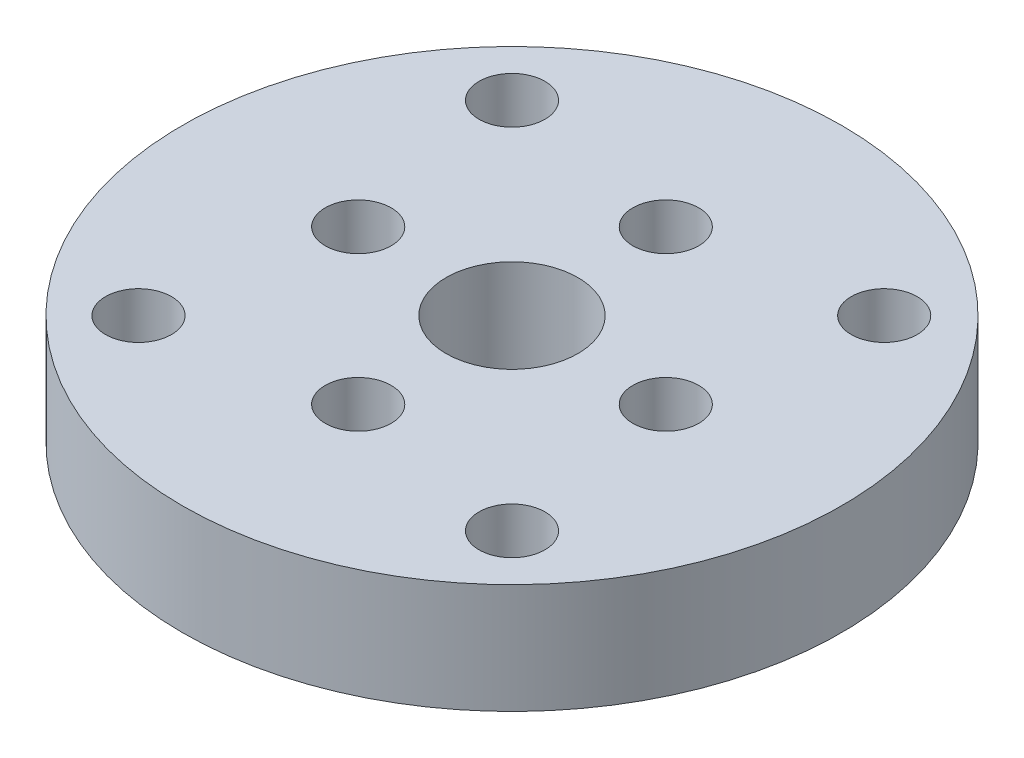
ISO-10303-21;
HEADER;
FILE_DESCRIPTION(('STEP AP214'),'2;1');
FILE_NAME('part.step','',(''),(''),'','','');
FILE_SCHEMA(('AUTOMOTIVE_DESIGN { 1 0 10303 214 1 1 1 1 }'));
ENDSEC;
DATA;
#1=APPLICATION_CONTEXT('core data for automotive mechanical design processes');
#2=APPLICATION_PROTOCOL_DEFINITION('international standard','automotive_design',2000,#1);
#3=PRODUCT_CONTEXT('',#1,'mechanical');
#4=PRODUCT('Part','Part','',(#3));
#5=PRODUCT_RELATED_PRODUCT_CATEGORY('part','',(#4));
#6=PRODUCT_DEFINITION_FORMATION('','',#4);
#7=PRODUCT_DEFINITION_CONTEXT('part definition',#1,'design');
#8=PRODUCT_DEFINITION('design','',#6,#7);
#9=PRODUCT_DEFINITION_SHAPE('','',#8);
#10=(LENGTH_UNIT() NAMED_UNIT(*) SI_UNIT(.MILLI.,.METRE.));
#11=(NAMED_UNIT(*) PLANE_ANGLE_UNIT() SI_UNIT($,.RADIAN.));
#12=(NAMED_UNIT(*) SI_UNIT($,.STERADIAN.) SOLID_ANGLE_UNIT());
#13=UNCERTAINTY_MEASURE_WITH_UNIT(LENGTH_MEASURE(1.E-05),#10,'distance_accuracy_value','');
#14=(GEOMETRIC_REPRESENTATION_CONTEXT(3) GLOBAL_UNCERTAINTY_ASSIGNED_CONTEXT((#13)) GLOBAL_UNIT_ASSIGNED_CONTEXT((#10,
#11,#12)) REPRESENTATION_CONTEXT('',''));
#15=CARTESIAN_POINT('',(0.,0.,0.));
#16=DIRECTION('',(0.,0.,1.));
#17=DIRECTION('',(1.,0.,0.));
#18=AXIS2_PLACEMENT_3D('',#15,#16,#17);
#19=CARTESIAN_POINT('',(0.,5.,0.));
#20=DIRECTION('',(0.,-1.,0.));
#21=DIRECTION('',(0.,0.,-1.));
#22=AXIS2_PLACEMENT_3D('',#19,#20,#21);
#23=CYLINDRICAL_SURFACE('',#22,15.);
#24=CARTESIAN_POINT('',(0.,5.,0.));
#25=DIRECTION('',(0.,1.,0.));
#26=DIRECTION('',(0.,0.,1.));
#27=AXIS2_PLACEMENT_3D('',#24,#25,#26);
#28=CIRCLE('',#27,15.);
#29=CARTESIAN_POINT('',(0.,5.,15.));
#30=VERTEX_POINT('',#29);
#31=EDGE_CURVE('E10',#30,#30,#28,.T.);
#32=ORIENTED_EDGE('',*,*,#31,.F.);
#33=EDGE_LOOP('',(#32));
#34=FACE_BOUND('',#33,.T.);
#35=CARTESIAN_POINT('',(0.,0.,0.));
#36=DIRECTION('',(0.,1.,0.));
#37=DIRECTION('',(0.,0.,1.));
#38=AXIS2_PLACEMENT_3D('',#35,#36,#37);
#39=CIRCLE('',#38,15.);
#40=CARTESIAN_POINT('',(0.,0.,15.));
#41=VERTEX_POINT('',#40);
#42=EDGE_CURVE('E39',#41,#41,#39,.T.);
#43=ORIENTED_EDGE('',*,*,#42,.T.);
#44=EDGE_LOOP('',(#43));
#45=FACE_BOUND('',#44,.T.);
#46=ADVANCED_FACE('F32',(#34,#45),#23,.T.);
#47=CARTESIAN_POINT('',(0.,5.,0.));
#48=DIRECTION('',(0.,1.,0.));
#49=DIRECTION('',(0.,0.,1.));
#50=AXIS2_PLACEMENT_3D('',#47,#48,#49);
#51=PLANE('',#50);
#52=CARTESIAN_POINT('',(0.,5.,0.));
#53=DIRECTION('',(0.,1.,0.));
#54=DIRECTION('',(0.,0.,1.));
#55=AXIS2_PLACEMENT_3D('',#52,#53,#54);
#56=CIRCLE('',#55,3.);
#57=CARTESIAN_POINT('',(0.,5.,3.));
#58=VERTEX_POINT('',#57);
#59=EDGE_CURVE('E93',#58,#58,#56,.T.);
#60=ORIENTED_EDGE('',*,*,#59,.F.);
#61=EDGE_LOOP('',(#60));
#62=FACE_BOUND('',#61,.T.);
#63=CARTESIAN_POINT('',(7.,5.,3.70363462121048E-13));
#64=DIRECTION('',(0.,1.,0.));
#65=DIRECTION('',(0.,0.,1.));
#66=AXIS2_PLACEMENT_3D('',#63,#64,#65);
#67=CIRCLE('',#66,1.50000000000042);
#68=CARTESIAN_POINT('',(7.,5.,1.50000000000079));
#69=VERTEX_POINT('',#68);
#70=EDGE_CURVE('E88',#69,#69,#67,.T.);
#71=ORIENTED_EDGE('',*,*,#70,.F.);
#72=EDGE_LOOP('',(#71));
#73=FACE_BOUND('',#72,.T.);
#74=CARTESIAN_POINT('',(1.99926880606327E-13,5.,7.0000000000002));
#75=DIRECTION('',(0.,1.,0.));
#76=DIRECTION('',(0.,0.,1.));
#77=AXIS2_PLACEMENT_3D('',#74,#75,#76);
#78=CIRCLE('',#77,1.50000000000026);
#79=CARTESIAN_POINT('',(1.99926880606327E-13,5.,8.50000000000046));
#80=VERTEX_POINT('',#79);
#81=EDGE_CURVE('E82',#80,#80,#78,.T.);
#82=ORIENTED_EDGE('',*,*,#81,.F.);
#83=EDGE_LOOP('',(#82));
#84=FACE_BOUND('',#83,.T.);
#85=CARTESIAN_POINT('',(-7.,5.,3.94649590784724E-13));
#86=DIRECTION('',(0.,1.,0.));
#87=DIRECTION('',(0.,0.,1.));
#88=AXIS2_PLACEMENT_3D('',#85,#86,#87);
#89=CIRCLE('',#88,1.50000000000036);
#90=CARTESIAN_POINT('',(-7.,5.,1.50000000000075));
#91=VERTEX_POINT('',#90);
#92=EDGE_CURVE('E76',#91,#91,#89,.T.);
#93=ORIENTED_EDGE('',*,*,#92,.F.);
#94=EDGE_LOOP('',(#93));
#95=FACE_BOUND('',#94,.T.);
#96=CARTESIAN_POINT('',(1.75207071073658E-13,5.,-6.9999999999998));
#97=DIRECTION('',(0.,1.,0.));
#98=DIRECTION('',(0.,0.,1.));
#99=AXIS2_PLACEMENT_3D('',#96,#97,#98);
#100=CIRCLE('',#99,1.50000000000032);
#101=CARTESIAN_POINT('',(1.75207071073658E-13,5.,-5.49999999999949));
#102=VERTEX_POINT('',#101);
#103=EDGE_CURVE('E70',#102,#102,#100,.T.);
#104=ORIENTED_EDGE('',*,*,#103,.F.);
#105=EDGE_LOOP('',(#104));
#106=FACE_BOUND('',#105,.T.);
#107=CARTESIAN_POINT('',(8.48528137423856,5.,8.48528137423856));
#108=DIRECTION('',(0.,-1.,0.));
#109=DIRECTION('',(0.,0.,-1.));
#110=AXIS2_PLACEMENT_3D('',#107,#108,#109);
#111=CIRCLE('',#110,1.5);
#112=CARTESIAN_POINT('',(8.48528137423856,5.,6.98528137423857));
#113=VERTEX_POINT('',#112);
#114=EDGE_CURVE('E49',#113,#113,#111,.T.);
#115=ORIENTED_EDGE('',*,*,#114,.T.);
#116=EDGE_LOOP('',(#115));
#117=FACE_BOUND('',#116,.T.);
#118=CARTESIAN_POINT('',(-8.48528137423857,5.,-8.48528137423857));
#119=DIRECTION('',(0.,-1.,0.));
#120=DIRECTION('',(0.,0.,-1.));
#121=AXIS2_PLACEMENT_3D('',#118,#119,#120);
#122=CIRCLE('',#121,1.5);
#123=CARTESIAN_POINT('',(-8.48528137423857,5.,-9.98528137423857));
#124=VERTEX_POINT('',#123);
#125=EDGE_CURVE('E55',#124,#124,#122,.T.);
#126=ORIENTED_EDGE('',*,*,#125,.T.);
#127=EDGE_LOOP('',(#126));
#128=FACE_BOUND('',#127,.T.);
#129=CARTESIAN_POINT('',(8.47056274847714,5.,-8.47056274847714));
#130=DIRECTION('',(0.,-1.,0.));
#131=DIRECTION('',(0.,0.,-1.));
#132=AXIS2_PLACEMENT_3D('',#129,#130,#131);
#133=CIRCLE('',#132,1.5);
#134=CARTESIAN_POINT('',(8.47056274847714,5.,-9.97056274847714));
#135=VERTEX_POINT('',#134);
#136=EDGE_CURVE('E56',#135,#135,#133,.T.);
#137=ORIENTED_EDGE('',*,*,#136,.T.);
#138=EDGE_LOOP('',(#137));
#139=FACE_BOUND('',#138,.T.);
#140=CARTESIAN_POINT('',(-8.5,5.,8.5));
#141=DIRECTION('',(0.,-1.,0.));
#142=DIRECTION('',(0.,0.,-1.));
#143=AXIS2_PLACEMENT_3D('',#140,#141,#142);
#144=CIRCLE('',#143,1.5);
#145=CARTESIAN_POINT('',(-8.5,5.,7.));
#146=VERTEX_POINT('',#145);
#147=EDGE_CURVE('E44',#146,#146,#144,.T.);
#148=ORIENTED_EDGE('',*,*,#147,.T.);
#149=EDGE_LOOP('',(#148));
#150=FACE_BOUND('',#149,.T.);
#151=ORIENTED_EDGE('',*,*,#31,.T.);
#152=EDGE_LOOP('',(#151));
#153=FACE_BOUND('',#152,.T.);
#154=ADVANCED_FACE('F114',(#62,#73,#84,#95,#106,#117,#128,#139,#150,#153),#51,.T.);
#155=CARTESIAN_POINT('',(0.,0.,0.));
#156=DIRECTION('',(0.,1.,0.));
#157=DIRECTION('',(0.,0.,1.));
#158=AXIS2_PLACEMENT_3D('',#155,#156,#157);
#159=PLANE('',#158);
#160=CARTESIAN_POINT('',(0.,0.,0.));
#161=DIRECTION('',(0.,1.,0.));
#162=DIRECTION('',(0.,0.,1.));
#163=AXIS2_PLACEMENT_3D('',#160,#161,#162);
#164=CIRCLE('',#163,3.);
#165=CARTESIAN_POINT('',(0.,0.,3.));
#166=VERTEX_POINT('',#165);
#167=EDGE_CURVE('E35',#166,#166,#164,.T.);
#168=ORIENTED_EDGE('',*,*,#167,.T.);
#169=EDGE_LOOP('',(#168));
#170=FACE_BOUND('',#169,.T.);
#171=CARTESIAN_POINT('',(7.,0.,3.70363462121048E-13));
#172=DIRECTION('',(0.,1.,0.));
#173=DIRECTION('',(0.,0.,1.));
#174=AXIS2_PLACEMENT_3D('',#171,#172,#173);
#175=CIRCLE('',#174,1.50000000000042);
#176=CARTESIAN_POINT('',(7.,0.,1.50000000000079));
#177=VERTEX_POINT('',#176);
#178=EDGE_CURVE('E67',#177,#177,#175,.T.);
#179=ORIENTED_EDGE('',*,*,#178,.T.);
#180=EDGE_LOOP('',(#179));
#181=FACE_BOUND('',#180,.T.);
#182=CARTESIAN_POINT('',(1.99926880606327E-13,0.,7.0000000000002));
#183=DIRECTION('',(0.,1.,0.));
#184=DIRECTION('',(0.,0.,1.));
#185=AXIS2_PLACEMENT_3D('',#182,#183,#184);
#186=CIRCLE('',#185,1.50000000000026);
#187=CARTESIAN_POINT('',(1.99926880606327E-13,0.,8.50000000000046));
#188=VERTEX_POINT('',#187);
#189=EDGE_CURVE('E85',#188,#188,#186,.T.);
#190=ORIENTED_EDGE('',*,*,#189,.T.);
#191=EDGE_LOOP('',(#190));
#192=FACE_BOUND('',#191,.T.);
#193=CARTESIAN_POINT('',(-7.,0.,3.94649590784724E-13));
#194=DIRECTION('',(0.,1.,0.));
#195=DIRECTION('',(0.,0.,1.));
#196=AXIS2_PLACEMENT_3D('',#193,#194,#195);
#197=CIRCLE('',#196,1.50000000000036);
#198=CARTESIAN_POINT('',(-7.,0.,1.50000000000075));
#199=VERTEX_POINT('',#198);
#200=EDGE_CURVE('E79',#199,#199,#197,.T.);
#201=ORIENTED_EDGE('',*,*,#200,.T.);
#202=EDGE_LOOP('',(#201));
#203=FACE_BOUND('',#202,.T.);
#204=CARTESIAN_POINT('',(1.75207071073658E-13,0.,-6.9999999999998));
#205=DIRECTION('',(0.,1.,0.));
#206=DIRECTION('',(0.,0.,1.));
#207=AXIS2_PLACEMENT_3D('',#204,#205,#206);
#208=CIRCLE('',#207,1.50000000000032);
#209=CARTESIAN_POINT('',(1.75207071073658E-13,0.,-5.49999999999949));
#210=VERTEX_POINT('',#209);
#211=EDGE_CURVE('E73',#210,#210,#208,.T.);
#212=ORIENTED_EDGE('',*,*,#211,.T.);
#213=EDGE_LOOP('',(#212));
#214=FACE_BOUND('',#213,.T.);
#215=CARTESIAN_POINT('',(8.48528137423856,0.,8.48528137423856));
#216=DIRECTION('',(0.,-1.,0.));
#217=DIRECTION('',(0.,0.,-1.));
#218=AXIS2_PLACEMENT_3D('',#215,#216,#217);
#219=CIRCLE('',#218,1.5);
#220=CARTESIAN_POINT('',(8.48528137423856,0.,6.98528137423857));
#221=VERTEX_POINT('',#220);
#222=EDGE_CURVE('E59',#221,#221,#219,.T.);
#223=ORIENTED_EDGE('',*,*,#222,.F.);
#224=EDGE_LOOP('',(#223));
#225=FACE_BOUND('',#224,.T.);
#226=CARTESIAN_POINT('',(-8.48528137423857,0.,-8.48528137423857));
#227=DIRECTION('',(0.,-1.,0.));
#228=DIRECTION('',(0.,0.,-1.));
#229=AXIS2_PLACEMENT_3D('',#226,#227,#228);
#230=CIRCLE('',#229,1.5);
#231=CARTESIAN_POINT('',(-8.48528137423857,0.,-9.98528137423857));
#232=VERTEX_POINT('',#231);
#233=EDGE_CURVE('E52',#232,#232,#230,.T.);
#234=ORIENTED_EDGE('',*,*,#233,.F.);
#235=EDGE_LOOP('',(#234));
#236=FACE_BOUND('',#235,.T.);
#237=CARTESIAN_POINT('',(8.47056274847714,0.,-8.47056274847714));
#238=DIRECTION('',(0.,-1.,0.));
#239=DIRECTION('',(0.,0.,-1.));
#240=AXIS2_PLACEMENT_3D('',#237,#238,#239);
#241=CIRCLE('',#240,1.5);
#242=CARTESIAN_POINT('',(8.47056274847714,0.,-9.97056274847714));
#243=VERTEX_POINT('',#242);
#244=EDGE_CURVE('E64',#243,#243,#241,.T.);
#245=ORIENTED_EDGE('',*,*,#244,.F.);
#246=EDGE_LOOP('',(#245));
#247=FACE_BOUND('',#246,.T.);
#248=CARTESIAN_POINT('',(-8.5,0.,8.5));
#249=DIRECTION('',(0.,-1.,0.));
#250=DIRECTION('',(0.,0.,-1.));
#251=AXIS2_PLACEMENT_3D('',#248,#249,#250);
#252=CIRCLE('',#251,1.5);
#253=CARTESIAN_POINT('',(-8.5,0.,7.));
#254=VERTEX_POINT('',#253);
#255=EDGE_CURVE('E46',#254,#254,#252,.T.);
#256=ORIENTED_EDGE('',*,*,#255,.F.);
#257=EDGE_LOOP('',(#256));
#258=FACE_BOUND('',#257,.T.);
#259=ORIENTED_EDGE('',*,*,#42,.F.);
#260=EDGE_LOOP('',(#259));
#261=FACE_BOUND('',#260,.T.);
#262=ADVANCED_FACE('F100',(#170,#181,#192,#203,#214,#225,#236,#247,#258,#261),#159,.F.);
#263=CARTESIAN_POINT('',(-8.5,5.,8.5));
#264=DIRECTION('',(0.,-1.,0.));
#265=DIRECTION('',(0.,0.,-1.));
#266=AXIS2_PLACEMENT_3D('',#263,#264,#265);
#267=CYLINDRICAL_SURFACE('',#266,1.5);
#268=ORIENTED_EDGE('',*,*,#147,.F.);
#269=EDGE_LOOP('',(#268));
#270=FACE_BOUND('',#269,.T.);
#271=ORIENTED_EDGE('',*,*,#255,.T.);
#272=EDGE_LOOP('',(#271));
#273=FACE_BOUND('',#272,.T.);
#274=ADVANCED_FACE('F126',(#270,#273),#267,.F.);
#275=CARTESIAN_POINT('',(8.47056274847714,5.,-8.47056274847714));
#276=DIRECTION('',(0.,-1.,0.));
#277=DIRECTION('',(0.,0.,-1.));
#278=AXIS2_PLACEMENT_3D('',#275,#276,#277);
#279=CYLINDRICAL_SURFACE('',#278,1.5);
#280=ORIENTED_EDGE('',*,*,#136,.F.);
#281=EDGE_LOOP('',(#280));
#282=FACE_BOUND('',#281,.T.);
#283=ORIENTED_EDGE('',*,*,#244,.T.);
#284=EDGE_LOOP('',(#283));
#285=FACE_BOUND('',#284,.T.);
#286=ADVANCED_FACE('F130',(#282,#285),#279,.F.);
#287=CARTESIAN_POINT('',(-8.48528137423857,5.,-8.48528137423857));
#288=DIRECTION('',(0.,-1.,0.));
#289=DIRECTION('',(0.,0.,-1.));
#290=AXIS2_PLACEMENT_3D('',#287,#288,#289);
#291=CYLINDRICAL_SURFACE('',#290,1.5);
#292=ORIENTED_EDGE('',*,*,#125,.F.);
#293=EDGE_LOOP('',(#292));
#294=FACE_BOUND('',#293,.T.);
#295=ORIENTED_EDGE('',*,*,#233,.T.);
#296=EDGE_LOOP('',(#295));
#297=FACE_BOUND('',#296,.T.);
#298=ADVANCED_FACE('F134',(#294,#297),#291,.F.);
#299=CARTESIAN_POINT('',(8.48528137423856,5.,8.48528137423856));
#300=DIRECTION('',(0.,-1.,0.));
#301=DIRECTION('',(0.,0.,-1.));
#302=AXIS2_PLACEMENT_3D('',#299,#300,#301);
#303=CYLINDRICAL_SURFACE('',#302,1.5);
#304=ORIENTED_EDGE('',*,*,#114,.F.);
#305=EDGE_LOOP('',(#304));
#306=FACE_BOUND('',#305,.T.);
#307=ORIENTED_EDGE('',*,*,#222,.T.);
#308=EDGE_LOOP('',(#307));
#309=FACE_BOUND('',#308,.T.);
#310=ADVANCED_FACE('F137',(#306,#309),#303,.F.);
#311=CARTESIAN_POINT('',(1.75207071073658E-13,0.,-6.9999999999998));
#312=DIRECTION('',(0.,1.,0.));
#313=DIRECTION('',(0.,0.,1.));
#314=AXIS2_PLACEMENT_3D('',#311,#312,#313);
#315=CYLINDRICAL_SURFACE('',#314,1.50000000000032);
#316=ORIENTED_EDGE('',*,*,#211,.F.);
#317=EDGE_LOOP('',(#316));
#318=FACE_BOUND('',#317,.T.);
#319=ORIENTED_EDGE('',*,*,#103,.T.);
#320=EDGE_LOOP('',(#319));
#321=FACE_BOUND('',#320,.T.);
#322=ADVANCED_FACE('F141',(#318,#321),#315,.F.);
#323=CARTESIAN_POINT('',(-7.,0.,3.94649590784724E-13));
#324=DIRECTION('',(0.,1.,0.));
#325=DIRECTION('',(0.,0.,1.));
#326=AXIS2_PLACEMENT_3D('',#323,#324,#325);
#327=CYLINDRICAL_SURFACE('',#326,1.50000000000036);
#328=ORIENTED_EDGE('',*,*,#200,.F.);
#329=EDGE_LOOP('',(#328));
#330=FACE_BOUND('',#329,.T.);
#331=ORIENTED_EDGE('',*,*,#92,.T.);
#332=EDGE_LOOP('',(#331));
#333=FACE_BOUND('',#332,.T.);
#334=ADVANCED_FACE('F148',(#330,#333),#327,.F.);
#335=CARTESIAN_POINT('',(1.99926880606327E-13,0.,7.0000000000002));
#336=DIRECTION('',(0.,1.,0.));
#337=DIRECTION('',(0.,0.,1.));
#338=AXIS2_PLACEMENT_3D('',#335,#336,#337);
#339=CYLINDRICAL_SURFACE('',#338,1.50000000000026);
#340=ORIENTED_EDGE('',*,*,#189,.F.);
#341=EDGE_LOOP('',(#340));
#342=FACE_BOUND('',#341,.T.);
#343=ORIENTED_EDGE('',*,*,#81,.T.);
#344=EDGE_LOOP('',(#343));
#345=FACE_BOUND('',#344,.T.);
#346=ADVANCED_FACE('F110',(#342,#345),#339,.F.);
#347=CARTESIAN_POINT('',(7.,0.,3.70363462121048E-13));
#348=DIRECTION('',(0.,1.,0.));
#349=DIRECTION('',(0.,0.,1.));
#350=AXIS2_PLACEMENT_3D('',#347,#348,#349);
#351=CYLINDRICAL_SURFACE('',#350,1.50000000000042);
#352=ORIENTED_EDGE('',*,*,#178,.F.);
#353=EDGE_LOOP('',(#352));
#354=FACE_BOUND('',#353,.T.);
#355=ORIENTED_EDGE('',*,*,#70,.T.);
#356=EDGE_LOOP('',(#355));
#357=FACE_BOUND('',#356,.T.);
#358=ADVANCED_FACE('F105',(#354,#357),#351,.F.);
#359=CARTESIAN_POINT('',(0.,-5.,0.));
#360=DIRECTION('',(0.,1.,0.));
#361=DIRECTION('',(0.,0.,1.));
#362=AXIS2_PLACEMENT_3D('',#359,#360,#361);
#363=CYLINDRICAL_SURFACE('',#362,3.);
#364=ORIENTED_EDGE('',*,*,#59,.T.);
#365=EDGE_LOOP('',(#364));
#366=FACE_BOUND('',#365,.T.);
#367=ORIENTED_EDGE('',*,*,#167,.F.);
#368=EDGE_LOOP('',(#367));
#369=FACE_BOUND('',#368,.T.);
#370=ADVANCED_FACE('F103',(#366,#369),#363,.F.);
#371=CLOSED_SHELL('',(#46,#154,#262,#274,#286,#298,#310,#322,#334,#346,#358,#370));
#372=MANIFOLD_SOLID_BREP('B2',#371);
#373=ADVANCED_BREP_SHAPE_REPRESENTATION('',(#18,#372),#14);
#374=SHAPE_DEFINITION_REPRESENTATION(#9,#373);
ENDSEC;
END-ISO-10303-21;
